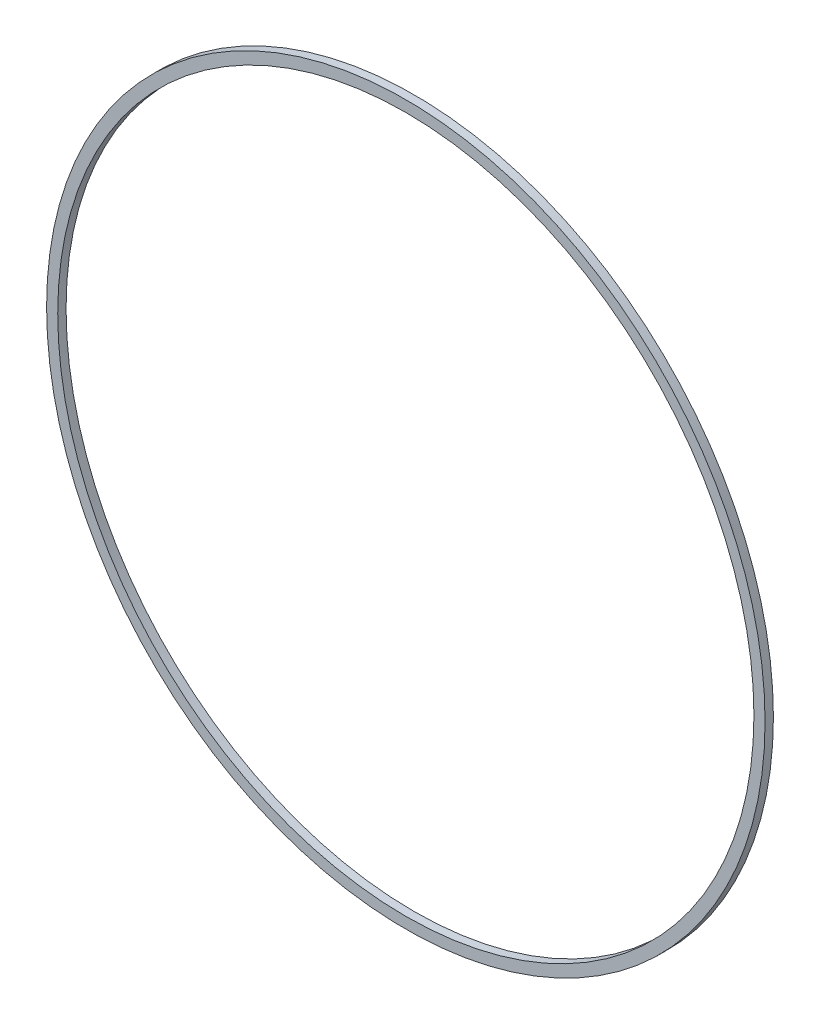
ISO-10303-21;
HEADER;
FILE_DESCRIPTION(('STEP AP214'),'2;1');
FILE_NAME('part.step','',(''),(''),'','','');
FILE_SCHEMA(('AUTOMOTIVE_DESIGN { 1 0 10303 214 1 1 1 1 }'));
ENDSEC;
DATA;
#1=APPLICATION_CONTEXT('core data for automotive mechanical design processes');
#2=APPLICATION_PROTOCOL_DEFINITION('international standard','automotive_design',2000,#1);
#3=PRODUCT_CONTEXT('',#1,'mechanical');
#4=PRODUCT('Part','Part','',(#3));
#5=PRODUCT_RELATED_PRODUCT_CATEGORY('part','',(#4));
#6=PRODUCT_DEFINITION_FORMATION('','',#4);
#7=PRODUCT_DEFINITION_CONTEXT('part definition',#1,'design');
#8=PRODUCT_DEFINITION('design','',#6,#7);
#9=PRODUCT_DEFINITION_SHAPE('','',#8);
#10=(LENGTH_UNIT() NAMED_UNIT(*) SI_UNIT(.MILLI.,.METRE.));
#11=(NAMED_UNIT(*) PLANE_ANGLE_UNIT() SI_UNIT($,.RADIAN.));
#12=(NAMED_UNIT(*) SI_UNIT($,.STERADIAN.) SOLID_ANGLE_UNIT());
#13=UNCERTAINTY_MEASURE_WITH_UNIT(LENGTH_MEASURE(1.E-05),#10,'distance_accuracy_value','');
#14=(GEOMETRIC_REPRESENTATION_CONTEXT(3) GLOBAL_UNCERTAINTY_ASSIGNED_CONTEXT((#13)) GLOBAL_UNIT_ASSIGNED_CONTEXT((#10,
#11,#12)) REPRESENTATION_CONTEXT('',''));
#15=CARTESIAN_POINT('',(0.,0.,0.));
#16=DIRECTION('',(0.,0.,1.));
#17=DIRECTION('',(1.,0.,0.));
#18=AXIS2_PLACEMENT_3D('',#15,#16,#17);
#19=CARTESIAN_POINT('',(0.,0.,6.));
#20=DIRECTION('',(0.,0.,1.));
#21=DIRECTION('',(1.,0.,0.));
#22=AXIS2_PLACEMENT_3D('',#19,#20,#21);
#23=PLANE('',#22);
#24=CARTESIAN_POINT('',(0.,0.,6.));
#25=DIRECTION('',(0.,0.,1.));
#26=DIRECTION('',(1.,0.,0.));
#27=AXIS2_PLACEMENT_3D('',#24,#25,#26);
#28=CIRCLE('',#27,258.);
#29=CARTESIAN_POINT('',(258.,0.,6.));
#30=VERTEX_POINT('',#29);
#31=EDGE_CURVE('E10',#30,#30,#28,.T.);
#32=ORIENTED_EDGE('',*,*,#31,.T.);
#33=EDGE_LOOP('',(#32));
#34=FACE_BOUND('',#33,.T.);
#35=CARTESIAN_POINT('',(0.,0.,6.));
#36=DIRECTION('',(0.,0.,1.));
#37=DIRECTION('',(1.,0.,0.));
#38=AXIS2_PLACEMENT_3D('',#35,#36,#37);
#39=CIRCLE('',#38,250.);
#40=CARTESIAN_POINT('',(250.,0.,6.));
#41=VERTEX_POINT('',#40);
#42=EDGE_CURVE('E42',#41,#41,#39,.T.);
#43=ORIENTED_EDGE('',*,*,#42,.F.);
#44=EDGE_LOOP('',(#43));
#45=FACE_BOUND('',#44,.T.);
#46=ADVANCED_FACE('F31',(#34,#45),#23,.T.);
#47=CARTESIAN_POINT('',(0.,0.,0.));
#48=DIRECTION('',(0.,0.,1.));
#49=DIRECTION('',(1.,0.,0.));
#50=AXIS2_PLACEMENT_3D('',#47,#48,#49);
#51=PLANE('',#50);
#52=CARTESIAN_POINT('',(0.,0.,0.));
#53=DIRECTION('',(0.,0.,1.));
#54=DIRECTION('',(1.,0.,0.));
#55=AXIS2_PLACEMENT_3D('',#52,#53,#54);
#56=CIRCLE('',#55,258.);
#57=CARTESIAN_POINT('',(258.,0.,0.));
#58=VERTEX_POINT('',#57);
#59=EDGE_CURVE('E35',#58,#58,#56,.T.);
#60=ORIENTED_EDGE('',*,*,#59,.F.);
#61=EDGE_LOOP('',(#60));
#62=FACE_BOUND('',#61,.T.);
#63=CARTESIAN_POINT('',(0.,0.,0.));
#64=DIRECTION('',(0.,0.,1.));
#65=DIRECTION('',(1.,0.,0.));
#66=AXIS2_PLACEMENT_3D('',#63,#64,#65);
#67=CIRCLE('',#66,250.);
#68=CARTESIAN_POINT('',(250.,0.,0.));
#69=VERTEX_POINT('',#68);
#70=EDGE_CURVE('E44',#69,#69,#67,.T.);
#71=ORIENTED_EDGE('',*,*,#70,.T.);
#72=EDGE_LOOP('',(#71));
#73=FACE_BOUND('',#72,.T.);
#74=ADVANCED_FACE('F54',(#62,#73),#51,.F.);
#75=CARTESIAN_POINT('',(0.,0.,6.));
#76=DIRECTION('',(0.,0.,-1.));
#77=DIRECTION('',(-1.,0.,0.));
#78=AXIS2_PLACEMENT_3D('',#75,#76,#77);
#79=CYLINDRICAL_SURFACE('',#78,258.);
#80=ORIENTED_EDGE('',*,*,#31,.F.);
#81=EDGE_LOOP('',(#80));
#82=FACE_BOUND('',#81,.T.);
#83=ORIENTED_EDGE('',*,*,#59,.T.);
#84=EDGE_LOOP('',(#83));
#85=FACE_BOUND('',#84,.T.);
#86=ADVANCED_FACE('F33',(#82,#85),#79,.T.);
#87=CARTESIAN_POINT('',(0.,0.,6.));
#88=DIRECTION('',(0.,0.,-1.));
#89=DIRECTION('',(-1.,0.,0.));
#90=AXIS2_PLACEMENT_3D('',#87,#88,#89);
#91=CYLINDRICAL_SURFACE('',#90,250.);
#92=ORIENTED_EDGE('',*,*,#42,.T.);
#93=EDGE_LOOP('',(#92));
#94=FACE_BOUND('',#93,.T.);
#95=ORIENTED_EDGE('',*,*,#70,.F.);
#96=EDGE_LOOP('',(#95));
#97=FACE_BOUND('',#96,.T.);
#98=ADVANCED_FACE('F50',(#94,#97),#91,.F.);
#99=CLOSED_SHELL('',(#46,#74,#86,#98));
#100=MANIFOLD_SOLID_BREP('B2',#99);
#101=ADVANCED_BREP_SHAPE_REPRESENTATION('',(#18,#100),#14);
#102=SHAPE_DEFINITION_REPRESENTATION(#9,#101);
ENDSEC;
END-ISO-10303-21;
